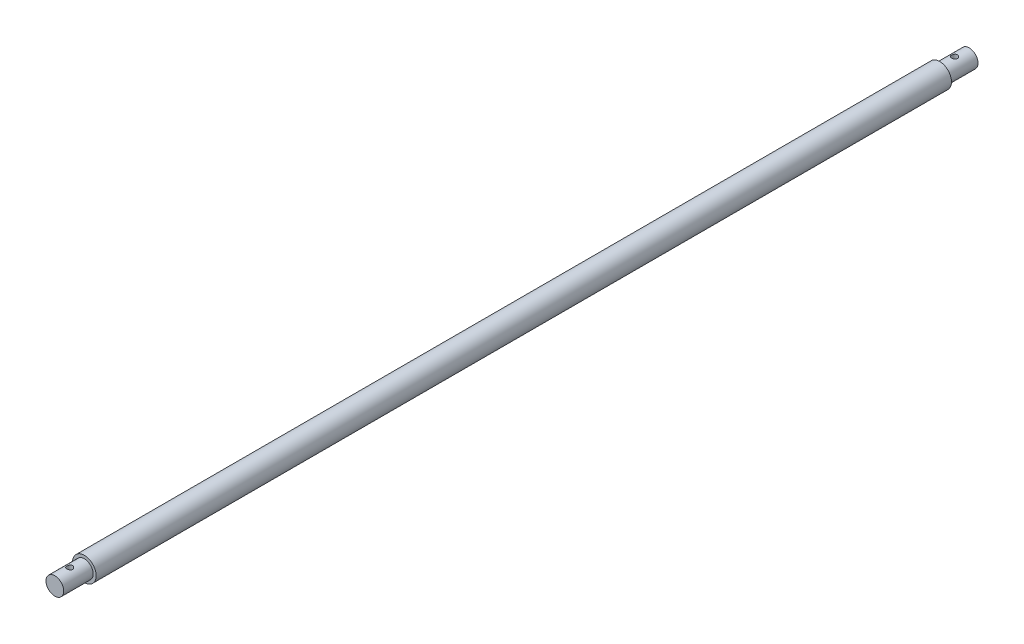
ISO-10303-21;
HEADER;
FILE_DESCRIPTION(('STEP AP214'),'2;1');
FILE_NAME('part.step','',(''),(''),'','','');
FILE_SCHEMA(('AUTOMOTIVE_DESIGN { 1 0 10303 214 1 1 1 1 }'));
ENDSEC;
DATA;
#1=APPLICATION_CONTEXT('core data for automotive mechanical design processes');
#2=APPLICATION_PROTOCOL_DEFINITION('international standard','automotive_design',2000,#1);
#3=PRODUCT_CONTEXT('',#1,'mechanical');
#4=PRODUCT('Part','Part','',(#3));
#5=PRODUCT_RELATED_PRODUCT_CATEGORY('part','',(#4));
#6=PRODUCT_DEFINITION_FORMATION('','',#4);
#7=PRODUCT_DEFINITION_CONTEXT('part definition',#1,'design');
#8=PRODUCT_DEFINITION('design','',#6,#7);
#9=PRODUCT_DEFINITION_SHAPE('','',#8);
#10=(LENGTH_UNIT() NAMED_UNIT(*) SI_UNIT(.MILLI.,.METRE.));
#11=(NAMED_UNIT(*) PLANE_ANGLE_UNIT() SI_UNIT($,.RADIAN.));
#12=(NAMED_UNIT(*) SI_UNIT($,.STERADIAN.) SOLID_ANGLE_UNIT());
#13=UNCERTAINTY_MEASURE_WITH_UNIT(LENGTH_MEASURE(1.E-05),#10,'distance_accuracy_value','');
#14=(GEOMETRIC_REPRESENTATION_CONTEXT(3) GLOBAL_UNCERTAINTY_ASSIGNED_CONTEXT((#13)) GLOBAL_UNIT_ASSIGNED_CONTEXT((#10,
#11,#12)) REPRESENTATION_CONTEXT('',''));
#15=CARTESIAN_POINT('',(0.,0.,0.));
#16=DIRECTION('',(0.,0.,1.));
#17=DIRECTION('',(1.,0.,0.));
#18=AXIS2_PLACEMENT_3D('',#15,#16,#17);
#19=CARTESIAN_POINT('',(0.,0.,10.));
#20=DIRECTION('',(0.,0.,-1.));
#21=DIRECTION('',(-1.,0.,0.));
#22=AXIS2_PLACEMENT_3D('',#19,#20,#21);
#23=CYLINDRICAL_SURFACE('',#22,3.);
#24=CARTESIAN_POINT('',(0.,0.,10.));
#25=DIRECTION('',(0.,0.,-1.));
#26=DIRECTION('',(-1.,0.,0.));
#27=AXIS2_PLACEMENT_3D('',#24,#25,#26);
#28=CIRCLE('',#27,3.);
#29=CARTESIAN_POINT('',(-3.,0.,10.));
#30=VERTEX_POINT('',#29);
#31=EDGE_CURVE('E88',#30,#30,#28,.T.);
#32=ORIENTED_EDGE('',*,*,#31,.T.);
#33=EDGE_LOOP('',(#32));
#34=FACE_BOUND('',#33,.T.);
#35=CARTESIAN_POINT('',(0.,0.,0.));
#36=DIRECTION('',(0.,0.,-1.));
#37=DIRECTION('',(-1.,0.,0.));
#38=AXIS2_PLACEMENT_3D('',#35,#36,#37);
#39=CIRCLE('',#38,3.);
#40=CARTESIAN_POINT('',(-3.,0.,0.));
#41=VERTEX_POINT('',#40);
#42=EDGE_CURVE('E91',#41,#41,#39,.T.);
#43=ORIENTED_EDGE('',*,*,#42,.F.);
#44=EDGE_LOOP('',(#43));
#45=FACE_BOUND('',#44,.T.);
#46=CARTESIAN_POINT('',(0.,-3.,4.));
#47=CARTESIAN_POINT('',(-0.0545633628867233,-3.00000015300943,3.99999974626836));
#48=CARTESIAN_POINT('',(-0.10912519453855,-2.99849769507545,4.00448026612722));
#49=CARTESIAN_POINT('',(-0.216641760872972,-2.99265210203281,4.02222910881722));
#50=CARTESIAN_POINT('',(-0.269596328118818,-2.98830867202153,4.03549834394892));
#51=CARTESIAN_POINT('',(-0.372332789501776,-2.97725307906443,4.07031924338405));
#52=CARTESIAN_POINT('',(-0.422119825886034,-2.97054487730853,4.09185706245927));
#53=CARTESIAN_POINT('',(-0.517374936805325,-2.95544445717342,4.14254117283835));
#54=CARTESIAN_POINT('',(-0.562842156958706,-2.94705190667778,4.1716889650026));
#55=CARTESIAN_POINT('',(-0.649741675022266,-2.92914094443005,4.23782580485875));
#56=CARTESIAN_POINT('',(-0.691003700298309,-2.91959556463785,4.27503123426049));
#57=CARTESIAN_POINT('',(-0.766832692702083,-2.90060314783122,4.35576715470657));
#58=CARTESIAN_POINT('',(-0.801398185489462,-2.89115613290549,4.39929903492851));
#59=CARTESIAN_POINT('',(-0.863824942227859,-2.87313332477274,4.49298511519646));
#60=CARTESIAN_POINT('',(-0.891464858221032,-2.86459039275688,4.54329373973212));
#61=CARTESIAN_POINT('',(-0.937818873877721,-2.84975305418601,4.64817609445855));
#62=CARTESIAN_POINT('',(-0.956535697386765,-2.84345796160746,4.70274851716274));
#63=CARTESIAN_POINT('',(-0.983873461509163,-2.83411303269377,4.81267322149671));
#64=CARTESIAN_POINT('',(-0.992813448271769,-2.83096095769611,4.86793720848907));
#65=CARTESIAN_POINT('',(-1.00134112333448,-2.82795656629508,4.97926375415588));
#66=CARTESIAN_POINT('',(-1.00093170160472,-2.8281032302273,5.03532606070919));
#67=CARTESIAN_POINT('',(-0.991019903703419,-2.8315901500818,5.14393663044402));
#68=CARTESIAN_POINT('',(-0.981933913166995,-2.83478415867533,5.19652840291902));
#69=CARTESIAN_POINT('',(-0.955606162849417,-2.84376657724551,5.29939341960683));
#70=CARTESIAN_POINT('',(-0.938363426591871,-2.84955529784108,5.34966638543507));
#71=CARTESIAN_POINT('',(-0.895939058060211,-2.86317911131249,5.44741274959148));
#72=CARTESIAN_POINT('',(-0.870634048707263,-2.87104565793117,5.49482802546953));
#73=CARTESIAN_POINT('',(-0.812889106303139,-2.88792558575726,5.58487090827973));
#74=CARTESIAN_POINT('',(-0.780447112364006,-2.89693929790464,5.62749712693338));
#75=CARTESIAN_POINT('',(-0.707349332682238,-2.91567329167741,5.70909159816077));
#76=CARTESIAN_POINT('',(-0.666353150076311,-2.92540589354843,5.74775269450907));
#77=CARTESIAN_POINT('',(-0.578339569970064,-2.94406938387037,5.8177312666634));
#78=CARTESIAN_POINT('',(-0.531321595660814,-2.95300019538067,5.8490480381645));
#79=CARTESIAN_POINT('',(-0.431947613046268,-2.96917107937794,5.90369630023507));
#80=CARTESIAN_POINT('',(-0.379543276416337,-2.97639350008039,5.92694549134073));
#81=CARTESIAN_POINT('',(-0.271269083364508,-2.98820567144435,5.96420317395571));
#82=CARTESIAN_POINT('',(-0.215400438154954,-2.99279633654879,5.97821487542344));
#83=CARTESIAN_POINT('',(-0.104383829529304,-2.99867627071441,5.99605566602236));
#84=CARTESIAN_POINT('',(-0.0493095998648453,-3.00010001833731,6.00029980917275));
#85=CARTESIAN_POINT('',(0.0607750699602365,-2.99988902694825,5.99966732640153));
#86=CARTESIAN_POINT('',(0.115785519319647,-2.99825480419352,5.99479224002013));
#87=CARTESIAN_POINT('',(0.222519866304259,-2.99220024717114,5.97638809226403));
#88=CARTESIAN_POINT('',(0.274292806834856,-2.98786198711228,5.96311379395048));
#89=CARTESIAN_POINT('',(0.374855958579561,-2.97691846830034,5.9286065555333));
#90=CARTESIAN_POINT('',(0.423645788508559,-2.97031292046541,5.90737260053232));
#91=CARTESIAN_POINT('',(0.518288296393322,-2.95528931287427,5.8569295681591));
#92=CARTESIAN_POINT('',(0.56402995921733,-2.94682814756305,5.8275254067164));
#93=CARTESIAN_POINT('',(0.650064830135404,-2.92905253915743,5.76180584998695));
#94=CARTESIAN_POINT('',(0.690356367794894,-2.91973783591888,5.72548834396984));
#95=CARTESIAN_POINT('',(0.766252507807014,-2.90076847982472,5.64502124899174));
#96=CARTESIAN_POINT('',(0.801560969248492,-2.89111761095155,5.60059077306675));
#97=CARTESIAN_POINT('',(0.864257522320854,-2.87299973286981,5.5062284321955));
#98=CARTESIAN_POINT('',(0.891645547920843,-2.8645327335312,5.4562965213898));
#99=CARTESIAN_POINT('',(0.937596930423361,-2.84982391820308,5.3523269846934));
#100=CARTESIAN_POINT('',(0.956178132197766,-2.84357760900632,5.29829792075722));
#101=CARTESIAN_POINT('',(0.983894666792163,-2.83410832399133,5.18762134987585));
#102=CARTESIAN_POINT('',(0.993034254961244,-2.83088398622698,5.13097503456694));
#103=CARTESIAN_POINT('',(1.00127628247038,-2.82797858875071,5.01980290398679));
#104=CARTESIAN_POINT('',(1.00087025731093,-2.82812400344299,4.96531765974826));
#105=CARTESIAN_POINT('',(0.991242293454878,-2.8315126992356,4.85723492510026));
#106=CARTESIAN_POINT('',(0.982020879458887,-2.83475579595884,4.80363738204709));
#107=CARTESIAN_POINT('',(0.95537181312698,-2.84384524278943,4.69986433698733));
#108=CARTESIAN_POINT('',(0.93810334601488,-2.84964098015514,4.64964317499277));
#109=CARTESIAN_POINT('',(0.895979365760382,-2.86316398825434,4.55277259306447));
#110=CARTESIAN_POINT('',(0.871122168553979,-2.87089168765297,4.50612396881274));
#111=CARTESIAN_POINT('',(0.813260692583249,-2.8878282922406,4.41551633007631));
#112=CARTESIAN_POINT('',(0.779948242764532,-2.89708711641604,4.37176349810141));
#113=CARTESIAN_POINT('',(0.706642883135697,-2.91583356283786,4.29031018661601));
#114=CARTESIAN_POINT('',(0.666648084451495,-2.92532124912518,4.25261142431198));
#115=CARTESIAN_POINT('',(0.579241556920675,-2.94390030525393,4.18285558771076));
#116=CARTESIAN_POINT('',(0.531601513499725,-2.95296181801216,4.15107565224898));
#117=CARTESIAN_POINT('',(0.431357357406629,-2.96925991172652,4.09600957114937));
#118=CARTESIAN_POINT('',(0.37875451813235,-2.9764969590794,4.07272125407796));
#119=CARTESIAN_POINT('',(0.272493647200975,-2.98805515068532,4.03627836751132));
#120=CARTESIAN_POINT('',(0.218987757676408,-2.9924921242252,4.02271753373662));
#121=CARTESIAN_POINT('',(0.110320416010247,-2.99846407064225,4.00457971932287));
#122=CARTESIAN_POINT('',(0.0551594255687464,-2.99999984531906,4.00000025650346));
#123=CARTESIAN_POINT('',(0.,-3.,4.));
#124=B_SPLINE_CURVE_WITH_KNOTS('',3,(#46,#47,#48,#49,#50,#51,#52,#53,#54,#55,#56,#57,#58,#59,
#60,#61,#62,#63,#64,#65,#66,#67,#68,#69,#70,#71,#72,#73,#74,#75,#76,#77,#78,#79,#80,#81,#82,#83,
#84,#85,#86,#87,#88,#89,#90,#91,#92,#93,#94,#95,#96,#97,#98,#99,#100,#101,#102,#103,#104,#105,
#106,#107,#108,#109,#110,#111,#112,#113,#114,#115,#116,#117,#118,#119,#120,#121,#122,#123),
.UNSPECIFIED.,.T.,.F.,(4,2,2,2,2,2,2,2,2,2,2,2,2,2,2,2,2,2,2,2,2,2,2,2,2,2,2,2,2,2,2,2,2,2,2,2,
2,2,4),(0.,0.163487106026011,0.326991185267521,0.490222672870274,0.6534863777991,
0.821846842827559,0.990244332875302,1.1634838482347,1.33667044692833,1.5040192574184,
1.67131633987485,1.8309682655128,1.99063930855482,2.15288171155131,2.31517102558207,
2.48593305811367,2.65671145966618,2.82918405650358,3.00159668877208,3.1665358317517,
3.33144713164177,3.49158157978213,3.65173645284104,3.81610399843737,3.98052180821891,
4.15241022880752,4.32430008234997,4.49584013824417,4.66730284700846,4.82995666056619,
4.99260079341185,5.15215587070227,5.31174638165788,5.47830066681615,5.64490211113589,
5.8179966082491,5.99104681142266,6.15636558363624,6.3216386602795),.UNSPECIFIED.);
#125=CARTESIAN_POINT('',(0.,-3.,4.));
#126=VERTEX_POINT('',#125);
#127=EDGE_CURVE('E45',#126,#126,#124,.T.);
#128=ORIENTED_EDGE('',*,*,#127,.T.);
#129=EDGE_LOOP('',(#128));
#130=FACE_BOUND('',#129,.T.);
#131=CARTESIAN_POINT('',(0.,3.,4.));
#132=CARTESIAN_POINT('',(0.0545633628867233,3.00000015300943,3.99999974626836));
#133=CARTESIAN_POINT('',(0.10912519453855,2.99849769507545,4.00448026612722));
#134=CARTESIAN_POINT('',(0.216641760872972,2.99265210203281,4.02222910881722));
#135=CARTESIAN_POINT('',(0.269596328118818,2.98830867202153,4.03549834394892));
#136=CARTESIAN_POINT('',(0.372332789501776,2.97725307906443,4.07031924338405));
#137=CARTESIAN_POINT('',(0.422119825886034,2.97054487730853,4.09185706245927));
#138=CARTESIAN_POINT('',(0.517374936805325,2.95544445717342,4.14254117283835));
#139=CARTESIAN_POINT('',(0.562842156958706,2.94705190667778,4.1716889650026));
#140=CARTESIAN_POINT('',(0.649741675022266,2.92914094443005,4.23782580485875));
#141=CARTESIAN_POINT('',(0.691003700298309,2.91959556463785,4.27503123426049));
#142=CARTESIAN_POINT('',(0.766832692702083,2.90060314783122,4.35576715470657));
#143=CARTESIAN_POINT('',(0.801398185489462,2.89115613290549,4.39929903492851));
#144=CARTESIAN_POINT('',(0.863824942227859,2.87313332477274,4.49298511519646));
#145=CARTESIAN_POINT('',(0.891464858221032,2.86459039275688,4.54329373973212));
#146=CARTESIAN_POINT('',(0.937818873877721,2.84975305418601,4.64817609445855));
#147=CARTESIAN_POINT('',(0.956535697386765,2.84345796160746,4.70274851716274));
#148=CARTESIAN_POINT('',(0.983873461509163,2.83411303269377,4.81267322149671));
#149=CARTESIAN_POINT('',(0.992813448271769,2.83096095769611,4.86793720848907));
#150=CARTESIAN_POINT('',(1.00134112333448,2.82795656629508,4.97926375415588));
#151=CARTESIAN_POINT('',(1.00093170160472,2.8281032302273,5.03532606070919));
#152=CARTESIAN_POINT('',(0.991019903703419,2.8315901500818,5.14393663044402));
#153=CARTESIAN_POINT('',(0.981933913166995,2.83478415867533,5.19652840291902));
#154=CARTESIAN_POINT('',(0.955606162849417,2.84376657724551,5.29939341960683));
#155=CARTESIAN_POINT('',(0.938363426591871,2.84955529784108,5.34966638543507));
#156=CARTESIAN_POINT('',(0.895939058060212,2.86317911131249,5.44741274959148));
#157=CARTESIAN_POINT('',(0.870634048707263,2.87104565793117,5.49482802546953));
#158=CARTESIAN_POINT('',(0.812889106303139,2.88792558575726,5.58487090827973));
#159=CARTESIAN_POINT('',(0.780447112364006,2.89693929790464,5.62749712693338));
#160=CARTESIAN_POINT('',(0.707349332682238,2.91567329167741,5.70909159816077));
#161=CARTESIAN_POINT('',(0.666353150076311,2.92540589354843,5.74775269450907));
#162=CARTESIAN_POINT('',(0.578339569970064,2.94406938387037,5.8177312666634));
#163=CARTESIAN_POINT('',(0.531321595660814,2.95300019538067,5.8490480381645));
#164=CARTESIAN_POINT('',(0.431947613046268,2.96917107937794,5.90369630023507));
#165=CARTESIAN_POINT('',(0.379543276416337,2.97639350008039,5.92694549134073));
#166=CARTESIAN_POINT('',(0.271269083364508,2.98820567144435,5.96420317395571));
#167=CARTESIAN_POINT('',(0.215400438154954,2.99279633654879,5.97821487542344));
#168=CARTESIAN_POINT('',(0.104383829529304,2.99867627071441,5.99605566602236));
#169=CARTESIAN_POINT('',(0.0493095998648454,3.00010001833731,6.00029980917275));
#170=CARTESIAN_POINT('',(-0.0607750699602364,2.99988902694825,5.99966732640153));
#171=CARTESIAN_POINT('',(-0.115785519319647,2.99825480419352,5.99479224002013));
#172=CARTESIAN_POINT('',(-0.222519866304259,2.99220024717114,5.97638809226403));
#173=CARTESIAN_POINT('',(-0.274292806834856,2.98786198711228,5.96311379395048));
#174=CARTESIAN_POINT('',(-0.374855958579561,2.97691846830034,5.9286065555333));
#175=CARTESIAN_POINT('',(-0.423645788508559,2.97031292046541,5.90737260053232));
#176=CARTESIAN_POINT('',(-0.518288296393321,2.95528931287427,5.8569295681591));
#177=CARTESIAN_POINT('',(-0.56402995921733,2.94682814756305,5.8275254067164));
#178=CARTESIAN_POINT('',(-0.650064830135404,2.92905253915743,5.76180584998695));
#179=CARTESIAN_POINT('',(-0.690356367794894,2.91973783591888,5.72548834396984));
#180=CARTESIAN_POINT('',(-0.766252507807013,2.90076847982472,5.64502124899174));
#181=CARTESIAN_POINT('',(-0.801560969248491,2.89111761095155,5.60059077306675));
#182=CARTESIAN_POINT('',(-0.864257522320854,2.87299973286981,5.5062284321955));
#183=CARTESIAN_POINT('',(-0.891645547920843,2.8645327335312,5.4562965213898));
#184=CARTESIAN_POINT('',(-0.93759693042336,2.84982391820308,5.35232698469341));
#185=CARTESIAN_POINT('',(-0.956178132197766,2.84357760900632,5.29829792075722));
#186=CARTESIAN_POINT('',(-0.983894666792163,2.83410832399133,5.18762134987585));
#187=CARTESIAN_POINT('',(-0.993034254961243,2.83088398622698,5.13097503456694));
#188=CARTESIAN_POINT('',(-1.00127628247038,2.82797858875071,5.01980290398679));
#189=CARTESIAN_POINT('',(-1.00087025731093,2.82812400344299,4.96531765974826));
#190=CARTESIAN_POINT('',(-0.991242293454878,2.8315126992356,4.85723492510026));
#191=CARTESIAN_POINT('',(-0.982020879458887,2.83475579595884,4.80363738204709));
#192=CARTESIAN_POINT('',(-0.95537181312698,2.84384524278943,4.69986433698733));
#193=CARTESIAN_POINT('',(-0.938103346014879,2.84964098015514,4.64964317499277));
#194=CARTESIAN_POINT('',(-0.895979365760381,2.86316398825434,4.55277259306447));
#195=CARTESIAN_POINT('',(-0.871122168553979,2.87089168765297,4.50612396881274));
#196=CARTESIAN_POINT('',(-0.813260692583249,2.8878282922406,4.41551633007631));
#197=CARTESIAN_POINT('',(-0.779948242764532,2.89708711641604,4.37176349810141));
#198=CARTESIAN_POINT('',(-0.706642883135697,2.91583356283786,4.29031018661601));
#199=CARTESIAN_POINT('',(-0.666648084451495,2.92532124912518,4.25261142431198));
#200=CARTESIAN_POINT('',(-0.579241556920675,2.94390030525393,4.18285558771076));
#201=CARTESIAN_POINT('',(-0.531601513499725,2.95296181801216,4.15107565224898));
#202=CARTESIAN_POINT('',(-0.431357357406629,2.96925991172652,4.09600957114937));
#203=CARTESIAN_POINT('',(-0.37875451813235,2.9764969590794,4.07272125407796));
#204=CARTESIAN_POINT('',(-0.272493647200975,2.98805515068532,4.03627836751132));
#205=CARTESIAN_POINT('',(-0.218987757676408,2.9924921242252,4.02271753373662));
#206=CARTESIAN_POINT('',(-0.110320416010247,2.99846407064225,4.00457971932287));
#207=CARTESIAN_POINT('',(-0.0551594255687463,2.99999984531906,4.00000025650346));
#208=CARTESIAN_POINT('',(0.,3.,4.));
#209=B_SPLINE_CURVE_WITH_KNOTS('',3,(#131,#132,#133,#134,#135,#136,#137,#138,#139,#140,#141,
#142,#143,#144,#145,#146,#147,#148,#149,#150,#151,#152,#153,#154,#155,#156,#157,#158,#159,#160,
#161,#162,#163,#164,#165,#166,#167,#168,#169,#170,#171,#172,#173,#174,#175,#176,#177,#178,#179,
#180,#181,#182,#183,#184,#185,#186,#187,#188,#189,#190,#191,#192,#193,#194,#195,#196,#197,#198,
#199,#200,#201,#202,#203,#204,#205,#206,#207,#208),.UNSPECIFIED.,.T.,.F.,(4,2,2,2,2,2,2,2,2,2,2,
2,2,2,2,2,2,2,2,2,2,2,2,2,2,2,2,2,2,2,2,2,2,2,2,2,2,2,4),(0.,0.163487106026011,
0.326991185267521,0.490222672870274,0.6534863777991,0.821846842827559,0.990244332875302,
1.1634838482347,1.33667044692833,1.5040192574184,1.67131633987485,1.8309682655128,
1.99063930855482,2.15288171155131,2.31517102558207,2.48593305811367,2.65671145966618,
2.82918405650358,3.00159668877208,3.1665358317517,3.33144713164177,3.49158157978213,
3.65173645284104,3.81610399843736,3.98052180821891,4.15241022880752,4.32430008234997,
4.49584013824416,4.66730284700846,4.82995666056619,4.99260079341185,5.15215587070228,
5.31174638165788,5.47830066681615,5.64490211113589,5.8179966082491,5.99104681142266,
6.15636558363624,6.3216386602795),.UNSPECIFIED.);
#210=CARTESIAN_POINT('',(0.,3.,4.));
#211=VERTEX_POINT('',#210);
#212=EDGE_CURVE('E10',#211,#211,#209,.T.);
#213=ORIENTED_EDGE('',*,*,#212,.T.);
#214=EDGE_LOOP('',(#213));
#215=FACE_BOUND('',#214,.T.);
#216=ADVANCED_FACE('F33',(#34,#45,#130,#215),#23,.T.);
#217=CARTESIAN_POINT('',(0.,0.,300.));
#218=DIRECTION('',(0.,0.,-1.));
#219=DIRECTION('',(-1.,0.,0.));
#220=AXIS2_PLACEMENT_3D('',#217,#218,#219);
#221=CYLINDRICAL_SURFACE('',#220,4.);
#222=CARTESIAN_POINT('',(0.,0.,300.));
#223=DIRECTION('',(0.,0.,1.));
#224=DIRECTION('',(1.,0.,0.));
#225=AXIS2_PLACEMENT_3D('',#222,#223,#224);
#226=CIRCLE('',#225,4.);
#227=CARTESIAN_POINT('',(4.,0.,300.));
#228=VERTEX_POINT('',#227);
#229=EDGE_CURVE('E101',#228,#228,#226,.T.);
#230=ORIENTED_EDGE('',*,*,#229,.F.);
#231=EDGE_LOOP('',(#230));
#232=FACE_BOUND('',#231,.T.);
#233=CARTESIAN_POINT('',(0.,0.,10.));
#234=DIRECTION('',(0.,0.,-1.));
#235=DIRECTION('',(-1.,0.,0.));
#236=AXIS2_PLACEMENT_3D('',#233,#234,#235);
#237=CIRCLE('',#236,4.);
#238=CARTESIAN_POINT('',(-4.,0.,10.));
#239=VERTEX_POINT('',#238);
#240=EDGE_CURVE('E93',#239,#239,#237,.T.);
#241=ORIENTED_EDGE('',*,*,#240,.F.);
#242=EDGE_LOOP('',(#241));
#243=FACE_BOUND('',#242,.T.);
#244=ADVANCED_FACE('F35',(#232,#243),#221,.T.);
#245=CARTESIAN_POINT('',(0.,0.,310.));
#246=DIRECTION('',(0.,0.,-1.));
#247=DIRECTION('',(-1.,0.,0.));
#248=AXIS2_PLACEMENT_3D('',#245,#246,#247);
#249=CYLINDRICAL_SURFACE('',#248,3.);
#250=CARTESIAN_POINT('',(0.,0.,310.));
#251=DIRECTION('',(0.,0.,1.));
#252=DIRECTION('',(1.,0.,0.));
#253=AXIS2_PLACEMENT_3D('',#250,#251,#252);
#254=CIRCLE('',#253,3.);
#255=CARTESIAN_POINT('',(3.,0.,310.));
#256=VERTEX_POINT('',#255);
#257=EDGE_CURVE('E98',#256,#256,#254,.T.);
#258=ORIENTED_EDGE('',*,*,#257,.F.);
#259=EDGE_LOOP('',(#258));
#260=FACE_BOUND('',#259,.T.);
#261=CARTESIAN_POINT('',(0.,0.,300.));
#262=DIRECTION('',(0.,0.,1.));
#263=DIRECTION('',(1.,0.,0.));
#264=AXIS2_PLACEMENT_3D('',#261,#262,#263);
#265=CIRCLE('',#264,3.);
#266=CARTESIAN_POINT('',(3.,0.,300.));
#267=VERTEX_POINT('',#266);
#268=EDGE_CURVE('E102',#267,#267,#265,.T.);
#269=ORIENTED_EDGE('',*,*,#268,.T.);
#270=EDGE_LOOP('',(#269));
#271=FACE_BOUND('',#270,.T.);
#272=CARTESIAN_POINT('',(0.,-3.,304.));
#273=CARTESIAN_POINT('',(0.0545633628867216,-3.00000015300943,303.999999746268));
#274=CARTESIAN_POINT('',(0.109125194538545,-2.99849769507545,304.004480266127));
#275=CARTESIAN_POINT('',(0.216641760872969,-2.99265210203281,304.022229108817));
#276=CARTESIAN_POINT('',(0.269596328118818,-2.98830867202153,304.035498343949));
#277=CARTESIAN_POINT('',(0.372332789501776,-2.97725307906442,304.070319243384));
#278=CARTESIAN_POINT('',(0.422119825886029,-2.97054487730853,304.091857062459));
#279=CARTESIAN_POINT('',(0.517374936805319,-2.95544445717342,304.142541172838));
#280=CARTESIAN_POINT('',(0.562842156958704,-2.94705190667778,304.171688965003));
#281=CARTESIAN_POINT('',(0.649741675022284,-2.92914094443005,304.237825804859));
#282=CARTESIAN_POINT('',(0.691003700298342,-2.91959556463784,304.275031234261));
#283=CARTESIAN_POINT('',(0.766832692702115,-2.90060314783121,304.355767154707));
#284=CARTESIAN_POINT('',(0.801398185489479,-2.89115613290549,304.399299034929));
#285=CARTESIAN_POINT('',(0.863824942227862,-2.87313332477274,304.492985115196));
#286=CARTESIAN_POINT('',(0.891464858221038,-2.86459039275688,304.543293739732));
#287=CARTESIAN_POINT('',(0.937818873877726,-2.84975305418601,304.648176094459));
#288=CARTESIAN_POINT('',(0.956535697386764,-2.84345796160746,304.702748517163));
#289=CARTESIAN_POINT('',(0.983873461509156,-2.83411303269377,304.812673221497));
#290=CARTESIAN_POINT('',(0.992813448271763,-2.83096095769611,304.867937208489));
#291=CARTESIAN_POINT('',(1.00134112333448,-2.82795656629507,304.979263754156));
#292=CARTESIAN_POINT('',(1.00093170160472,-2.8281032302273,305.035326060709));
#293=CARTESIAN_POINT('',(0.991019903703423,-2.8315901500818,305.143936630444));
#294=CARTESIAN_POINT('',(0.981933913166995,-2.83478415867533,305.196528402919));
#295=CARTESIAN_POINT('',(0.955606162849421,-2.84376657724551,305.299393419607));
#296=CARTESIAN_POINT('',(0.93836342659188,-2.84955529784107,305.349666385435));
#297=CARTESIAN_POINT('',(0.895939058060211,-2.86317911131249,305.447412749591));
#298=CARTESIAN_POINT('',(0.870634048707248,-2.87104565793118,305.49482802547));
#299=CARTESIAN_POINT('',(0.812889106303116,-2.88792558575727,305.58487090828));
#300=CARTESIAN_POINT('',(0.78044711236399,-2.89693929790464,305.627497126933));
#301=CARTESIAN_POINT('',(0.707349332682243,-2.91567329167741,305.709091598161));
#302=CARTESIAN_POINT('',(0.666353150076329,-2.92540589354842,305.747752694509));
#303=CARTESIAN_POINT('',(0.578339569970075,-2.94406938387036,305.817731266663));
#304=CARTESIAN_POINT('',(0.531321595660806,-2.95300019538067,305.849048038164));
#305=CARTESIAN_POINT('',(0.431947613046254,-2.96917107937794,305.903696300235));
#306=CARTESIAN_POINT('',(0.37954327641634,-2.97639350008039,305.926945491341));
#307=CARTESIAN_POINT('',(0.271269083364533,-2.98820567144434,305.964203173956));
#308=CARTESIAN_POINT('',(0.215400438154986,-2.99279633654878,305.978214875423));
#309=CARTESIAN_POINT('',(0.104383829529337,-2.99867627071441,305.996055666022));
#310=CARTESIAN_POINT('',(0.0493095998648744,-3.00010001833731,306.000299809173));
#311=CARTESIAN_POINT('',(-0.0607750699602174,-2.99988902694825,305.999667326402));
#312=CARTESIAN_POINT('',(-0.115785519319633,-2.99825480419352,305.99479224002));
#313=CARTESIAN_POINT('',(-0.222519866304251,-2.99220024717114,305.976388092264));
#314=CARTESIAN_POINT('',(-0.274292806834848,-2.98786198711228,305.96311379395));
#315=CARTESIAN_POINT('',(-0.374855958579558,-2.97691846830034,305.928606555533));
#316=CARTESIAN_POINT('',(-0.423645788508562,-2.97031292046541,305.907372600532));
#317=CARTESIAN_POINT('',(-0.518288296393314,-2.95528931287427,305.856929568159));
#318=CARTESIAN_POINT('',(-0.564029959217308,-2.94682814756306,305.827525406716));
#319=CARTESIAN_POINT('',(-0.650064830135381,-2.92905253915744,305.761805849987));
#320=CARTESIAN_POINT('',(-0.690356367794883,-2.91973783591888,305.72548834397));
#321=CARTESIAN_POINT('',(-0.766252507807018,-2.90076847982472,305.645021248992));
#322=CARTESIAN_POINT('',(-0.801560969248498,-2.89111761095155,305.600590773067));
#323=CARTESIAN_POINT('',(-0.864257522320858,-2.87299973286981,305.506228432195));
#324=CARTESIAN_POINT('',(-0.891645547920849,-2.8645327335312,305.45629652139));
#325=CARTESIAN_POINT('',(-0.937596930423368,-2.84982391820308,305.352326984693));
#326=CARTESIAN_POINT('',(-0.956178132197773,-2.84357760900631,305.298297920757));
#327=CARTESIAN_POINT('',(-0.983894666792168,-2.83410832399133,305.187621349876));
#328=CARTESIAN_POINT('',(-0.993034254961247,-2.83088398622698,305.130975034567));
#329=CARTESIAN_POINT('',(-1.00127628247038,-2.82797858875071,305.019802903987));
#330=CARTESIAN_POINT('',(-1.00087025731093,-2.82812400344299,304.965317659748));
#331=CARTESIAN_POINT('',(-0.991242293454868,-2.8315126992356,304.8572349251));
#332=CARTESIAN_POINT('',(-0.982020879458879,-2.83475579595884,304.803637382047));
#333=CARTESIAN_POINT('',(-0.955371813126976,-2.84384524278944,304.699864336987));
#334=CARTESIAN_POINT('',(-0.938103346014871,-2.84964098015514,304.649643174993));
#335=CARTESIAN_POINT('',(-0.895979365760366,-2.86316398825434,304.552772593064));
#336=CARTESIAN_POINT('',(-0.871122168553967,-2.87089168765297,304.506123968813));
#337=CARTESIAN_POINT('',(-0.81326069258325,-2.8878282922406,304.415516330076));
#338=CARTESIAN_POINT('',(-0.77994824276454,-2.89708711641604,304.371763498101));
#339=CARTESIAN_POINT('',(-0.706642883135702,-2.91583356283786,304.290310186616));
#340=CARTESIAN_POINT('',(-0.666648084451491,-2.92532124912518,304.252611424312));
#341=CARTESIAN_POINT('',(-0.579241556920674,-2.94390030525393,304.182855587711));
#342=CARTESIAN_POINT('',(-0.531601513499736,-2.95296181801216,304.151075652249));
#343=CARTESIAN_POINT('',(-0.431357357406649,-2.96925991172652,304.096009571149));
#344=CARTESIAN_POINT('',(-0.378754518132368,-2.9764969590794,304.072721254078));
#345=CARTESIAN_POINT('',(-0.27249364720099,-2.98805515068532,304.036278367511));
#346=CARTESIAN_POINT('',(-0.218987757676423,-2.9924921242252,304.022717533737));
#347=CARTESIAN_POINT('',(-0.110320416010256,-2.99846407064224,304.004579719323));
#348=CARTESIAN_POINT('',(-0.0551594255687501,-2.99999984531906,304.000000256503));
#349=CARTESIAN_POINT('',(0.,-3.,304.));
#350=B_SPLINE_CURVE_WITH_KNOTS('',3,(#272,#273,#274,#275,#276,#277,#278,#279,#280,#281,#282,
#283,#284,#285,#286,#287,#288,#289,#290,#291,#292,#293,#294,#295,#296,#297,#298,#299,#300,#301,
#302,#303,#304,#305,#306,#307,#308,#309,#310,#311,#312,#313,#314,#315,#316,#317,#318,#319,#320,
#321,#322,#323,#324,#325,#326,#327,#328,#329,#330,#331,#332,#333,#334,#335,#336,#337,#338,#339,
#340,#341,#342,#343,#344,#345,#346,#347,#348,#349),.UNSPECIFIED.,.T.,.F.,(4,2,2,2,2,2,2,2,2,2,2,
2,2,2,2,2,2,2,2,2,2,2,2,2,2,2,2,2,2,2,2,2,2,2,2,2,2,2,4),(0.,0.163487106026006,0.32699118526752,
0.490222672870258,0.653486377799104,0.821846842827613,0.990244332875344,1.16348384823471,
1.33667044692833,1.50401925741834,1.67131633987482,1.83096826551277,1.99063930855484,
2.15288171155134,2.31517102558206,2.48593305811366,2.65671145966619,2.82918405650357,
3.00159668877205,3.16653583175168,3.33144713164177,3.49158157978213,3.65173645284104,
3.81610399843735,3.98052180821891,4.15241022880756,4.32430008234998,4.49584013824419,
4.66730284700849,4.82995666056631,4.9926007934119,5.15215587070237,5.31174638165789,
5.47830066681619,5.6449021111359,5.8179966082491,5.99104681142268,6.15636558363625,
6.32163866027953),.UNSPECIFIED.);
#351=CARTESIAN_POINT('',(0.,-3.,304.));
#352=VERTEX_POINT('',#351);
#353=EDGE_CURVE('E53',#352,#352,#350,.T.);
#354=ORIENTED_EDGE('',*,*,#353,.F.);
#355=EDGE_LOOP('',(#354));
#356=FACE_BOUND('',#355,.T.);
#357=CARTESIAN_POINT('',(0.,3.,304.));
#358=CARTESIAN_POINT('',(-0.0545633628867216,3.00000015300943,303.999999746268));
#359=CARTESIAN_POINT('',(-0.109125194538545,2.99849769507545,304.004480266127));
#360=CARTESIAN_POINT('',(-0.216641760872969,2.99265210203281,304.022229108817));
#361=CARTESIAN_POINT('',(-0.269596328118818,2.98830867202153,304.035498343949));
#362=CARTESIAN_POINT('',(-0.372332789501776,2.97725307906442,304.070319243384));
#363=CARTESIAN_POINT('',(-0.422119825886029,2.97054487730853,304.091857062459));
#364=CARTESIAN_POINT('',(-0.517374936805319,2.95544445717342,304.142541172838));
#365=CARTESIAN_POINT('',(-0.562842156958704,2.94705190667778,304.171688965003));
#366=CARTESIAN_POINT('',(-0.649741675022284,2.92914094443005,304.237825804859));
#367=CARTESIAN_POINT('',(-0.691003700298342,2.91959556463784,304.275031234261));
#368=CARTESIAN_POINT('',(-0.766832692702115,2.90060314783121,304.355767154707));
#369=CARTESIAN_POINT('',(-0.801398185489479,2.89115613290549,304.399299034929));
#370=CARTESIAN_POINT('',(-0.863824942227862,2.87313332477274,304.492985115196));
#371=CARTESIAN_POINT('',(-0.891464858221038,2.86459039275688,304.543293739732));
#372=CARTESIAN_POINT('',(-0.937818873877726,2.84975305418601,304.648176094459));
#373=CARTESIAN_POINT('',(-0.956535697386764,2.84345796160746,304.702748517163));
#374=CARTESIAN_POINT('',(-0.983873461509156,2.83411303269377,304.812673221497));
#375=CARTESIAN_POINT('',(-0.992813448271763,2.83096095769611,304.867937208489));
#376=CARTESIAN_POINT('',(-1.00134112333448,2.82795656629507,304.979263754156));
#377=CARTESIAN_POINT('',(-1.00093170160472,2.8281032302273,305.035326060709));
#378=CARTESIAN_POINT('',(-0.991019903703423,2.8315901500818,305.143936630444));
#379=CARTESIAN_POINT('',(-0.981933913166995,2.83478415867533,305.196528402919));
#380=CARTESIAN_POINT('',(-0.955606162849421,2.84376657724551,305.299393419607));
#381=CARTESIAN_POINT('',(-0.93836342659188,2.84955529784107,305.349666385435));
#382=CARTESIAN_POINT('',(-0.895939058060211,2.86317911131249,305.447412749591));
#383=CARTESIAN_POINT('',(-0.870634048707248,2.87104565793118,305.49482802547));
#384=CARTESIAN_POINT('',(-0.812889106303116,2.88792558575727,305.58487090828));
#385=CARTESIAN_POINT('',(-0.78044711236399,2.89693929790464,305.627497126933));
#386=CARTESIAN_POINT('',(-0.707349332682243,2.91567329167741,305.709091598161));
#387=CARTESIAN_POINT('',(-0.666353150076329,2.92540589354842,305.747752694509));
#388=CARTESIAN_POINT('',(-0.578339569970075,2.94406938387036,305.817731266663));
#389=CARTESIAN_POINT('',(-0.531321595660806,2.95300019538067,305.849048038164));
#390=CARTESIAN_POINT('',(-0.431947613046254,2.96917107937794,305.903696300235));
#391=CARTESIAN_POINT('',(-0.37954327641634,2.97639350008039,305.926945491341));
#392=CARTESIAN_POINT('',(-0.271269083364533,2.98820567144434,305.964203173956));
#393=CARTESIAN_POINT('',(-0.215400438154986,2.99279633654878,305.978214875423));
#394=CARTESIAN_POINT('',(-0.104383829529337,2.99867627071441,305.996055666022));
#395=CARTESIAN_POINT('',(-0.0493095998648744,3.00010001833731,306.000299809173));
#396=CARTESIAN_POINT('',(0.0607750699602174,2.99988902694825,305.999667326402));
#397=CARTESIAN_POINT('',(0.115785519319633,2.99825480419352,305.99479224002));
#398=CARTESIAN_POINT('',(0.222519866304251,2.99220024717114,305.976388092264));
#399=CARTESIAN_POINT('',(0.274292806834848,2.98786198711228,305.96311379395));
#400=CARTESIAN_POINT('',(0.374855958579558,2.97691846830034,305.928606555533));
#401=CARTESIAN_POINT('',(0.423645788508562,2.97031292046541,305.907372600532));
#402=CARTESIAN_POINT('',(0.518288296393314,2.95528931287427,305.856929568159));
#403=CARTESIAN_POINT('',(0.564029959217308,2.94682814756306,305.827525406716));
#404=CARTESIAN_POINT('',(0.650064830135381,2.92905253915744,305.761805849987));
#405=CARTESIAN_POINT('',(0.690356367794883,2.91973783591888,305.72548834397));
#406=CARTESIAN_POINT('',(0.766252507807018,2.90076847982472,305.645021248992));
#407=CARTESIAN_POINT('',(0.801560969248498,2.89111761095155,305.600590773067));
#408=CARTESIAN_POINT('',(0.864257522320858,2.87299973286981,305.506228432195));
#409=CARTESIAN_POINT('',(0.891645547920849,2.8645327335312,305.45629652139));
#410=CARTESIAN_POINT('',(0.937596930423368,2.84982391820308,305.352326984693));
#411=CARTESIAN_POINT('',(0.956178132197773,2.84357760900631,305.298297920757));
#412=CARTESIAN_POINT('',(0.983894666792168,2.83410832399133,305.187621349876));
#413=CARTESIAN_POINT('',(0.993034254961247,2.83088398622698,305.130975034567));
#414=CARTESIAN_POINT('',(1.00127628247038,2.82797858875071,305.019802903987));
#415=CARTESIAN_POINT('',(1.00087025731093,2.82812400344299,304.965317659748));
#416=CARTESIAN_POINT('',(0.991242293454868,2.8315126992356,304.8572349251));
#417=CARTESIAN_POINT('',(0.982020879458879,2.83475579595884,304.803637382047));
#418=CARTESIAN_POINT('',(0.955371813126976,2.84384524278944,304.699864336987));
#419=CARTESIAN_POINT('',(0.938103346014871,2.84964098015514,304.649643174993));
#420=CARTESIAN_POINT('',(0.895979365760366,2.86316398825434,304.552772593064));
#421=CARTESIAN_POINT('',(0.871122168553967,2.87089168765297,304.506123968813));
#422=CARTESIAN_POINT('',(0.81326069258325,2.8878282922406,304.415516330076));
#423=CARTESIAN_POINT('',(0.77994824276454,2.89708711641604,304.371763498101));
#424=CARTESIAN_POINT('',(0.706642883135702,2.91583356283786,304.290310186616));
#425=CARTESIAN_POINT('',(0.666648084451491,2.92532124912518,304.252611424312));
#426=CARTESIAN_POINT('',(0.579241556920674,2.94390030525393,304.182855587711));
#427=CARTESIAN_POINT('',(0.531601513499736,2.95296181801216,304.151075652249));
#428=CARTESIAN_POINT('',(0.431357357406649,2.96925991172652,304.096009571149));
#429=CARTESIAN_POINT('',(0.378754518132368,2.9764969590794,304.072721254078));
#430=CARTESIAN_POINT('',(0.27249364720099,2.98805515068532,304.036278367511));
#431=CARTESIAN_POINT('',(0.218987757676423,2.9924921242252,304.022717533737));
#432=CARTESIAN_POINT('',(0.110320416010256,2.99846407064224,304.004579719323));
#433=CARTESIAN_POINT('',(0.0551594255687501,2.99999984531906,304.000000256503));
#434=CARTESIAN_POINT('',(0.,3.,304.));
#435=B_SPLINE_CURVE_WITH_KNOTS('',3,(#357,#358,#359,#360,#361,#362,#363,#364,#365,#366,#367,
#368,#369,#370,#371,#372,#373,#374,#375,#376,#377,#378,#379,#380,#381,#382,#383,#384,#385,#386,
#387,#388,#389,#390,#391,#392,#393,#394,#395,#396,#397,#398,#399,#400,#401,#402,#403,#404,#405,
#406,#407,#408,#409,#410,#411,#412,#413,#414,#415,#416,#417,#418,#419,#420,#421,#422,#423,#424,
#425,#426,#427,#428,#429,#430,#431,#432,#433,#434),.UNSPECIFIED.,.T.,.F.,(4,2,2,2,2,2,2,2,2,2,2,
2,2,2,2,2,2,2,2,2,2,2,2,2,2,2,2,2,2,2,2,2,2,2,2,2,2,2,4),(0.,0.163487106026006,0.32699118526752,
0.490222672870258,0.653486377799104,0.821846842827613,0.990244332875344,1.16348384823471,
1.33667044692833,1.50401925741834,1.67131633987482,1.83096826551277,1.99063930855484,
2.15288171155134,2.31517102558206,2.48593305811366,2.65671145966619,2.82918405650357,
3.00159668877205,3.16653583175168,3.33144713164177,3.49158157978213,3.65173645284104,
3.81610399843735,3.98052180821891,4.15241022880756,4.32430008234998,4.49584013824419,
4.66730284700849,4.82995666056631,4.9926007934119,5.15215587070237,5.31174638165789,
5.47830066681619,5.6449021111359,5.8179966082491,5.99104681142268,6.15636558363625,
6.32163866027953),.UNSPECIFIED.);
#436=CARTESIAN_POINT('',(0.,3.,304.));
#437=VERTEX_POINT('',#436);
#438=EDGE_CURVE('E49',#437,#437,#435,.T.);
#439=ORIENTED_EDGE('',*,*,#438,.F.);
#440=EDGE_LOOP('',(#439));
#441=FACE_BOUND('',#440,.T.);
#442=ADVANCED_FACE('F83',(#260,#271,#356,#441),#249,.T.);
#443=CARTESIAN_POINT('',(0.,0.,300.));
#444=DIRECTION('',(0.,0.,1.));
#445=DIRECTION('',(1.,0.,0.));
#446=AXIS2_PLACEMENT_3D('',#443,#444,#445);
#447=PLANE('',#446);
#448=ORIENTED_EDGE('',*,*,#268,.F.);
#449=EDGE_LOOP('',(#448));
#450=FACE_BOUND('',#449,.T.);
#451=ORIENTED_EDGE('',*,*,#229,.T.);
#452=EDGE_LOOP('',(#451));
#453=FACE_BOUND('',#452,.T.);
#454=ADVANCED_FACE('F120',(#450,#453),#447,.T.);
#455=CARTESIAN_POINT('',(0.,0.,310.));
#456=DIRECTION('',(0.,0.,1.));
#457=DIRECTION('',(1.,0.,0.));
#458=AXIS2_PLACEMENT_3D('',#455,#456,#457);
#459=PLANE('',#458);
#460=ORIENTED_EDGE('',*,*,#257,.T.);
#461=EDGE_LOOP('',(#460));
#462=FACE_BOUND('',#461,.T.);
#463=ADVANCED_FACE('F116',(#462),#459,.T.);
#464=CARTESIAN_POINT('',(0.,3.,305.));
#465=DIRECTION('',(0.,-1.,0.));
#466=DIRECTION('',(0.,0.,-1.));
#467=AXIS2_PLACEMENT_3D('',#464,#465,#466);
#468=CYLINDRICAL_SURFACE('',#467,1.);
#469=ORIENTED_EDGE('',*,*,#353,.T.);
#470=EDGE_LOOP('',(#469));
#471=FACE_BOUND('',#470,.T.);
#472=ORIENTED_EDGE('',*,*,#438,.T.);
#473=EDGE_LOOP('',(#472));
#474=FACE_BOUND('',#473,.T.);
#475=ADVANCED_FACE('F113',(#471,#474),#468,.F.);
#476=CARTESIAN_POINT('',(0.,0.,10.));
#477=DIRECTION('',(0.,0.,-1.));
#478=DIRECTION('',(-1.,0.,0.));
#479=AXIS2_PLACEMENT_3D('',#476,#477,#478);
#480=PLANE('',#479);
#481=ORIENTED_EDGE('',*,*,#31,.F.);
#482=EDGE_LOOP('',(#481));
#483=FACE_BOUND('',#482,.T.);
#484=ORIENTED_EDGE('',*,*,#240,.T.);
#485=EDGE_LOOP('',(#484));
#486=FACE_BOUND('',#485,.T.);
#487=ADVANCED_FACE('F75',(#483,#486),#480,.T.);
#488=CARTESIAN_POINT('',(0.,0.,0.));
#489=DIRECTION('',(0.,0.,1.));
#490=DIRECTION('',(1.,0.,0.));
#491=AXIS2_PLACEMENT_3D('',#488,#489,#490);
#492=PLANE('',#491);
#493=ORIENTED_EDGE('',*,*,#42,.T.);
#494=EDGE_LOOP('',(#493));
#495=FACE_BOUND('',#494,.T.);
#496=ADVANCED_FACE('F69',(#495),#492,.F.);
#497=CARTESIAN_POINT('',(0.,3.,5.));
#498=DIRECTION('',(0.,-1.,0.));
#499=DIRECTION('',(0.,0.,-1.));
#500=AXIS2_PLACEMENT_3D('',#497,#498,#499);
#501=CYLINDRICAL_SURFACE('',#500,1.);
#502=ORIENTED_EDGE('',*,*,#212,.F.);
#503=EDGE_LOOP('',(#502));
#504=FACE_BOUND('',#503,.T.);
#505=ORIENTED_EDGE('',*,*,#127,.F.);
#506=EDGE_LOOP('',(#505));
#507=FACE_BOUND('',#506,.T.);
#508=ADVANCED_FACE('F66',(#504,#507),#501,.F.);
#509=CLOSED_SHELL('',(#216,#244,#442,#454,#463,#475,#487,#496,#508));
#510=MANIFOLD_SOLID_BREP('B2',#509);
#511=ADVANCED_BREP_SHAPE_REPRESENTATION('',(#18,#510),#14);
#512=SHAPE_DEFINITION_REPRESENTATION(#9,#511);
ENDSEC;
END-ISO-10303-21;
